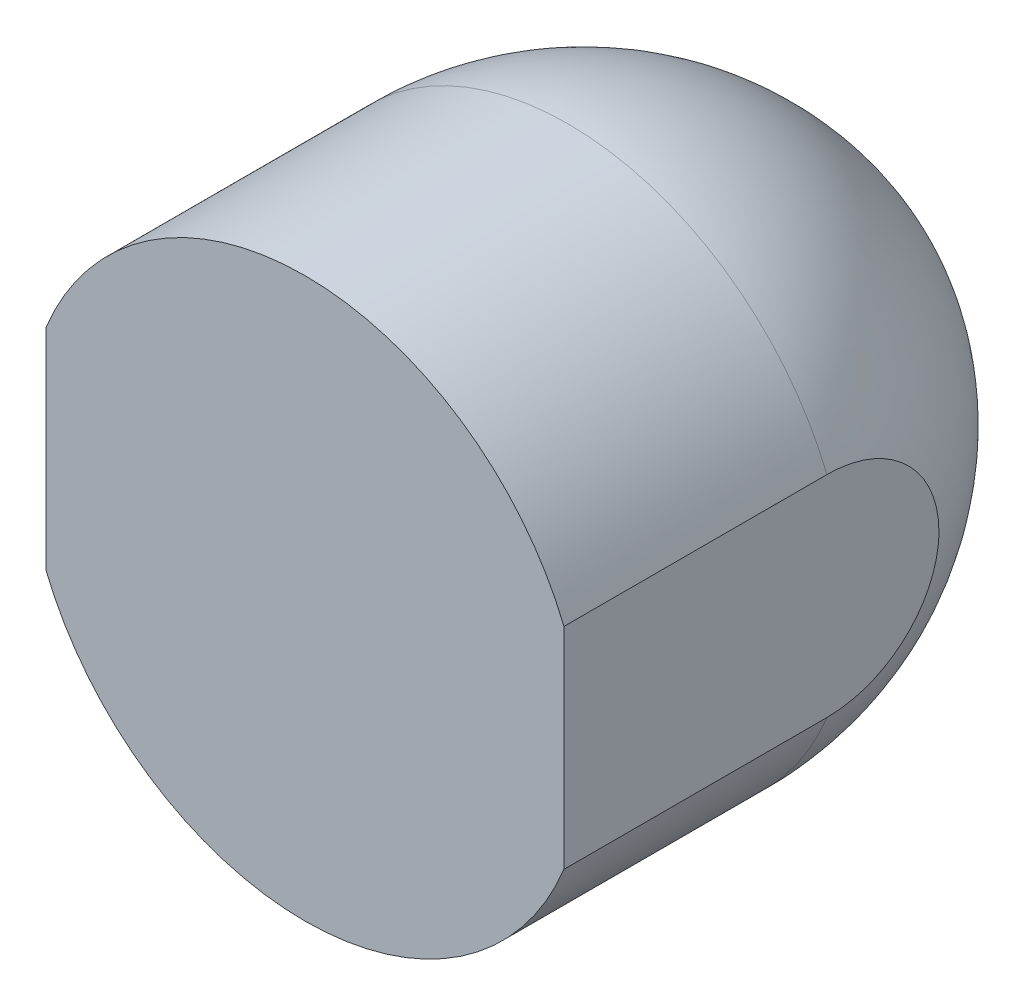
ISO-10303-21;
HEADER;
FILE_DESCRIPTION(('STEP AP214'),'2;1');
FILE_NAME('part.step','',(''),(''),'','','');
FILE_SCHEMA(('AUTOMOTIVE_DESIGN { 1 0 10303 214 1 1 1 1 }'));
ENDSEC;
DATA;
#1=APPLICATION_CONTEXT('core data for automotive mechanical design processes');
#2=APPLICATION_PROTOCOL_DEFINITION('international standard','automotive_design',2000,#1);
#3=PRODUCT_CONTEXT('',#1,'mechanical');
#4=PRODUCT('Part','Part','',(#3));
#5=PRODUCT_RELATED_PRODUCT_CATEGORY('part','',(#4));
#6=PRODUCT_DEFINITION_FORMATION('','',#4);
#7=PRODUCT_DEFINITION_CONTEXT('part definition',#1,'design');
#8=PRODUCT_DEFINITION('design','',#6,#7);
#9=PRODUCT_DEFINITION_SHAPE('','',#8);
#10=(LENGTH_UNIT() NAMED_UNIT(*) SI_UNIT(.MILLI.,.METRE.));
#11=(NAMED_UNIT(*) PLANE_ANGLE_UNIT() SI_UNIT($,.RADIAN.));
#12=(NAMED_UNIT(*) SI_UNIT($,.STERADIAN.) SOLID_ANGLE_UNIT());
#13=UNCERTAINTY_MEASURE_WITH_UNIT(LENGTH_MEASURE(1.E-05),#10,'distance_accuracy_value','');
#14=(GEOMETRIC_REPRESENTATION_CONTEXT(3) GLOBAL_UNCERTAINTY_ASSIGNED_CONTEXT((#13)) GLOBAL_UNIT_ASSIGNED_CONTEXT((#10,
#11,#12)) REPRESENTATION_CONTEXT('',''));
#15=CARTESIAN_POINT('',(0.,0.,0.));
#16=DIRECTION('',(0.,0.,1.));
#17=DIRECTION('',(1.,0.,0.));
#18=AXIS2_PLACEMENT_3D('',#15,#16,#17);
#19=CARTESIAN_POINT('',(0.,0.,0.));
#20=DIRECTION('',(0.,0.,1.));
#21=DIRECTION('',(1.,0.,0.));
#22=AXIS2_PLACEMENT_3D('',#19,#20,#21);
#23=CYLINDRICAL_SURFACE('',#22,5.315);
#24=CARTESIAN_POINT('',(0.,0.,0.));
#25=DIRECTION('',(0.,0.,1.));
#26=DIRECTION('',(1.,0.,0.));
#27=AXIS2_PLACEMENT_3D('',#24,#25,#26);
#28=CIRCLE('',#27,5.315);
#29=CARTESIAN_POINT('',(4.92435021094154,2.,0.));
#30=VERTEX_POINT('',#29);
#31=CARTESIAN_POINT('',(-4.92435021094154,2.,0.));
#32=VERTEX_POINT('',#31);
#33=EDGE_CURVE('E115',#30,#32,#28,.T.);
#34=ORIENTED_EDGE('',*,*,#33,.F.);
#35=DIRECTION('',(0.,0.,-1.));
#36=VECTOR('',#35,1.);
#37=CARTESIAN_POINT('',(4.92435021094154,2.,22.9802790586636));
#38=LINE('',#37,#36);
#39=CARTESIAN_POINT('',(4.92435021094154,2.,-5.00000000000153));
#40=VERTEX_POINT('',#39);
#41=EDGE_CURVE('E114',#30,#40,#38,.T.);
#42=ORIENTED_EDGE('',*,*,#41,.T.);
#43=CARTESIAN_POINT('',(0.,0.,-5.));
#44=DIRECTION('',(0.,0.,1.));
#45=DIRECTION('',(1.,0.,0.));
#46=AXIS2_PLACEMENT_3D('',#43,#44,#45);
#47=CIRCLE('',#46,5.315);
#48=CARTESIAN_POINT('',(-4.92435021094154,2.,-5.));
#49=VERTEX_POINT('',#48);
#50=EDGE_CURVE('E101',#40,#49,#47,.T.);
#51=ORIENTED_EDGE('',*,*,#50,.T.);
#52=DIRECTION('',(0.,0.,-1.));
#53=VECTOR('',#52,1.);
#54=CARTESIAN_POINT('',(-4.92435021094154,2.,23.2557879774949));
#55=LINE('',#54,#53);
#56=EDGE_CURVE('E126',#32,#49,#55,.T.);
#57=ORIENTED_EDGE('',*,*,#56,.F.);
#58=EDGE_LOOP('',(#34,#42,#51,#57));
#59=FACE_BOUND('',#58,.T.);
#60=ADVANCED_FACE('F50',(#59),#23,.T.);
#61=DIRECTION('',(0.,0.,-1.));
#62=VECTOR('',#61,1.);
#63=CARTESIAN_POINT('',(4.92435021094154,-2.,22.9802790586636));
#64=LINE('',#63,#62);
#65=CARTESIAN_POINT('',(4.92435021094154,-2.,0.));
#66=VERTEX_POINT('',#65);
#67=CARTESIAN_POINT('',(4.92435021094154,-2.,-5.));
#68=VERTEX_POINT('',#67);
#69=EDGE_CURVE('E79',#66,#68,#64,.T.);
#70=ORIENTED_EDGE('',*,*,#69,.F.);
#71=CARTESIAN_POINT('',(-4.92435021094154,-2.,0.));
#72=VERTEX_POINT('',#71);
#73=EDGE_CURVE('E136',#72,#66,#28,.T.);
#74=ORIENTED_EDGE('',*,*,#73,.F.);
#75=DIRECTION('',(0.,0.,-1.));
#76=VECTOR('',#75,1.);
#77=CARTESIAN_POINT('',(-4.92435021094154,-2.,23.2557879774949));
#78=LINE('',#77,#76);
#79=CARTESIAN_POINT('',(-4.92435021094154,-2.,-5.));
#80=VERTEX_POINT('',#79);
#81=EDGE_CURVE('E125',#72,#80,#78,.T.);
#82=ORIENTED_EDGE('',*,*,#81,.T.);
#83=EDGE_CURVE('E110',#80,#68,#47,.T.);
#84=ORIENTED_EDGE('',*,*,#83,.T.);
#85=EDGE_LOOP('',(#70,#74,#82,#84));
#86=FACE_BOUND('',#85,.T.);
#87=ADVANCED_FACE('F154',(#86),#23,.T.);
#88=CARTESIAN_POINT('',(0.,0.,0.));
#89=DIRECTION('',(0.,0.,1.));
#90=DIRECTION('',(1.,0.,0.));
#91=AXIS2_PLACEMENT_3D('',#88,#89,#90);
#92=PLANE('',#91);
#93=DIRECTION('',(0.,-1.,0.));
#94=VECTOR('',#93,1.);
#95=CARTESIAN_POINT('',(4.92435021094154,0.,0.));
#96=LINE('',#95,#94);
#97=EDGE_CURVE('E71',#30,#66,#96,.T.);
#98=ORIENTED_EDGE('',*,*,#97,.F.);
#99=ORIENTED_EDGE('',*,*,#33,.T.);
#100=DIRECTION('',(0.,-1.,0.));
#101=VECTOR('',#100,1.);
#102=CARTESIAN_POINT('',(-4.92435021094154,0.,0.));
#103=LINE('',#102,#101);
#104=EDGE_CURVE('E111',#32,#72,#103,.T.);
#105=ORIENTED_EDGE('',*,*,#104,.T.);
#106=ORIENTED_EDGE('',*,*,#73,.T.);
#107=EDGE_LOOP('',(#98,#99,#105,#106));
#108=FACE_BOUND('',#107,.T.);
#109=ADVANCED_FACE('F52',(#108),#92,.T.);
#110=CARTESIAN_POINT('',(-0.685,0.,-5.));
#111=DIRECTION('',(0.,-1.,0.));
#112=DIRECTION('',(1.,0.,0.));
#113=AXIS2_PLACEMENT_3D('',#110,#111,#112);
#114=CIRCLE('',#113,6.);
#115=TRIMMED_CURVE('',#114,(PARAMETER_VALUE(-1.45638018550953)),
(PARAMETER_VALUE(1.45638018550953)),.T.,.PARAMETER.);
#116=CARTESIAN_POINT('',(0.,0.,-5.));
#117=DIRECTION('',(0.,0.,1.));
#118=AXIS1_PLACEMENT('',#116,#117);
#119=SURFACE_OF_REVOLUTION('',#115,#118);
#120=CARTESIAN_POINT('',(4.92435021094154,0.,-7.12959860326074));
#121=CARTESIAN_POINT('',(4.92435021094154,0.111388284336316,-7.12959081609624));
#122=CARTESIAN_POINT('',(4.92435021094154,0.222898969085855,-7.1195907296075));
#123=CARTESIAN_POINT('',(4.92435021094154,0.442503890502322,-7.07999020523317));
#124=CARTESIAN_POINT('',(4.92435021094154,0.550591812685757,-7.05035552718025));
#125=CARTESIAN_POINT('',(4.92435021094154,0.759713787912702,-6.97283709799994));
#126=CARTESIAN_POINT('',(4.92435021094154,0.860763611001785,-6.92499580730524));
#127=CARTESIAN_POINT('',(4.92435021094154,1.05327193441051,-6.81296321223986));
#128=CARTESIAN_POINT('',(4.92435021094154,1.14473303940401,-6.74877636429666));
#129=CARTESIAN_POINT('',(4.92435021094154,1.31524803031152,-6.60684537702657));
#130=CARTESIAN_POINT('',(4.92435021094154,1.39438934353929,-6.52920589385143));
#131=CARTESIAN_POINT('',(4.92435021094154,1.53943382286217,-6.36243195499815));
#132=CARTESIAN_POINT('',(4.92435021094154,1.60533473101322,-6.27329554294703));
#133=CARTESIAN_POINT('',(4.92435021094154,1.72629570363239,-6.08017662038711));
#134=CARTESIAN_POINT('',(4.92435021094154,1.78043487487432,-5.97561720823739));
#135=CARTESIAN_POINT('',(4.92435021094154,1.87138355777602,-5.75921323726417));
#136=CARTESIAN_POINT('',(4.92435021094154,1.90818794785606,-5.64736653650003));
#137=CARTESIAN_POINT('',(4.92435021094154,1.96525435663889,-5.41338220755745));
#138=CARTESIAN_POINT('',(4.92435021094154,1.98456320614537,-5.29101146451928));
#139=CARTESIAN_POINT('',(4.92435021094154,2.00293425134514,-5.04475245356639));
#140=CARTESIAN_POINT('',(4.92435021094154,2.00199288875324,-4.92086392277457));
#141=CARTESIAN_POINT('',(4.92435021094154,1.9795869452336,-4.67172181471064));
#142=CARTESIAN_POINT('',(4.92435021094154,1.95759473421084,-4.54651517980073));
#143=CARTESIAN_POINT('',(4.92435021094154,1.8927317167567,-4.30161034889791));
#144=CARTESIAN_POINT('',(4.92435021094154,1.84986008496384,-4.18191237086642));
#145=CARTESIAN_POINT('',(4.92435021094154,1.74456959511716,-3.9526705614722));
#146=CARTESIAN_POINT('',(4.92435021094154,1.68232245376208,-3.84304808186927));
#147=CARTESIAN_POINT('',(4.92435021094154,1.539537523627,-3.63641356235644));
#148=CARTESIAN_POINT('',(4.92435021094154,1.45900335277329,-3.53939903403673));
#149=CARTESIAN_POINT('',(4.92435021094154,1.2854448477074,-3.36533916118107));
#150=CARTESIAN_POINT('',(4.92435021094154,1.19309725184549,-3.28762009118814));
#151=CARTESIAN_POINT('',(4.92435021094154,0.995937265108121,-3.15002782628413));
#152=CARTESIAN_POINT('',(4.92435021094154,0.891130268037518,-3.09014694811031));
#153=CARTESIAN_POINT('',(4.92435021094154,0.679085669592945,-2.9939338079647));
#154=CARTESIAN_POINT('',(4.92435021094154,0.572409736625026,-2.95636330184055));
#155=CARTESIAN_POINT('',(4.92435021094154,0.354083959722077,-2.90078415647459));
#156=CARTESIAN_POINT('',(4.92435021094154,0.24243601589735,-2.88276810993778));
#157=CARTESIAN_POINT('',(4.92435021094154,0.0236117013853664,-2.86750558177617));
#158=CARTESIAN_POINT('',(4.92435021094154,-0.0834936272604995,-2.86922340121465));
#159=CARTESIAN_POINT('',(4.92435021094154,-0.295837664959183,-2.8908638644222));
#160=CARTESIAN_POINT('',(4.92435021094154,-0.401076568777655,-2.91078459714523));
#161=CARTESIAN_POINT('',(4.92435021094154,-0.605454049587518,-2.96767475671745));
#162=CARTESIAN_POINT('',(4.92435021094154,-0.704650674100275,-3.00443674044997));
#163=CARTESIAN_POINT('',(4.92435021094154,-0.895746881107727,-3.09357337214418));
#164=CARTESIAN_POINT('',(4.92435021094154,-0.987645587578077,-3.14594989086006));
#165=CARTESIAN_POINT('',(4.92435021094154,-1.16488089093695,-3.26651629243262));
#166=CARTESIAN_POINT('',(4.92435021094154,-1.24990053257859,-3.33517129908479));
#167=CARTESIAN_POINT('',(4.92435021094154,-1.40799726027537,-3.48506207077591));
#168=CARTESIAN_POINT('',(4.92435021094154,-1.48107142216351,-3.56630090679483));
#169=CARTESIAN_POINT('',(4.92435021094154,-1.61770910107279,-3.74406445290551));
#170=CARTESIAN_POINT('',(4.92435021094154,-1.68047418651206,-3.8412027794568));
#171=CARTESIAN_POINT('',(4.92435021094154,-1.78982363295656,-4.04419033767337));
#172=CARTESIAN_POINT('',(4.92435021094154,-1.83640363034517,-4.15004190899278));
#173=CARTESIAN_POINT('',(4.92435021094154,-1.91471374763045,-4.37386289616066));
#174=CARTESIAN_POINT('',(4.92435021094154,-1.94545438040674,-4.49217907853447));
#175=CARTESIAN_POINT('',(4.92435021094154,-1.98738289285777,-4.73223178527231));
#176=CARTESIAN_POINT('',(4.92435021094154,-1.99856649102836,-4.85396905266839));
#177=CARTESIAN_POINT('',(4.92435021094154,-2.00121999819164,-5.10191870098301));
#178=CARTESIAN_POINT('',(4.92435021094154,-1.99198935487971,-5.22813919722855));
#179=CARTESIAN_POINT('',(4.92435021094154,-1.95253267623885,-5.47727204517889));
#180=CARTESIAN_POINT('',(4.92435021094154,-1.92230476081342,-5.60018409962191));
#181=CARTESIAN_POINT('',(4.92435021094154,-1.84135037404492,-5.83938211366062));
#182=CARTESIAN_POINT('',(4.92435021094154,-1.79057979555864,-5.95565319751973));
#183=CARTESIAN_POINT('',(4.92435021094154,-1.6696022263571,-6.17762340229917));
#184=CARTESIAN_POINT('',(4.92435021094154,-1.59939843761591,-6.28332426095363));
#185=CARTESIAN_POINT('',(4.92435021094154,-1.44383265756966,-6.47722010774136));
#186=CARTESIAN_POINT('',(4.92435021094154,-1.35905010453821,-6.56587914997245));
#187=CARTESIAN_POINT('',(4.92435021094154,-1.1749496928951,-6.72664359091557));
#188=CARTESIAN_POINT('',(4.92435021094154,-1.07563239897271,-6.79874963244884));
#189=CARTESIAN_POINT('',(4.92435021094154,-0.871531280490764,-6.91971997036061));
#190=CARTESIAN_POINT('',(4.92435021094154,-0.767405304504188,-6.96969555463998));
#191=CARTESIAN_POINT('',(4.92435021094154,-0.552002021884773,-7.05011089799906));
#192=CARTESIAN_POINT('',(4.92435021094154,-0.440740309657153,-7.08059176086378));
#193=CARTESIAN_POINT('',(4.92435021094154,-0.273682997584805,-7.11028805169918));
#194=CARTESIAN_POINT('',(4.92435021094154,-0.219208822455767,-7.11751886283337));
#195=CARTESIAN_POINT('',(4.92435021094154,-0.109833033153846,-7.12717616362175));
#196=CARTESIAN_POINT('',(4.92435021094154,-0.0549314004240601,-7.12960244351965));
#197=CARTESIAN_POINT('',(4.92435021094154,0.,-7.12959860326074));
#198=B_SPLINE_CURVE_WITH_KNOTS('',3,(#120,#121,#122,#123,#124,#125,#126,#127,#128,#129,#130,
#131,#132,#133,#134,#135,#136,#137,#138,#139,#140,#141,#142,#143,#144,#145,#146,#147,#148,#149,
#150,#151,#152,#153,#154,#155,#156,#157,#158,#159,#160,#161,#162,#163,#164,#165,#166,#167,#168,
#169,#170,#171,#172,#173,#174,#175,#176,#177,#178,#179,#180,#181,#182,#183,#184,#185,#186,#187,
#188,#189,#190,#191,#192,#193,#194,#195,#196,#197),.UNSPECIFIED.,.T.,.F.,(4,2,2,2,2,2,2,2,2,2,2,
2,2,2,2,2,2,2,2,2,2,2,2,2,2,2,2,2,2,2,2,2,2,2,2,2,2,2,4),(0.,0.333937009397587,
0.668457899560962,1.00220337302114,1.33585795186669,1.66702469376118,1.99824786311907,
2.34992732384284,2.70171062356453,3.07167341776833,3.44170122086566,3.82125328935883,
4.20082036272645,4.57711493069186,4.95333511688387,5.3135573543352,5.67362421184606,
6.01117870134139,6.34860527938787,6.66840714099602,6.98817543183108,7.30410668194259,
7.62007579852887,7.94648010025844,8.27296418413466,8.61840235918174,8.96393359472374,
9.32901781542802,9.69418195182713,10.072071122983,10.4499941347111,10.8287329275084,
11.2074093533231,11.5735365674754,11.9396495609923,12.284384224535,12.6283896125196,
12.7930642629571,12.9577461026041),.UNSPECIFIED.);
#199=EDGE_CURVE('E12',#68,#40,#198,.T.);
#200=ORIENTED_EDGE('',*,*,#199,.F.);
#201=ORIENTED_EDGE('',*,*,#83,.F.);
#202=CARTESIAN_POINT('',(-4.92435021094154,0.,-7.12959860326074));
#203=CARTESIAN_POINT('',(-4.92435021094154,0.111388284336316,-7.12959081609624));
#204=CARTESIAN_POINT('',(-4.92435021094154,0.222898969085856,-7.1195907296075));
#205=CARTESIAN_POINT('',(-4.92435021094154,0.442503890502322,-7.07999020523317));
#206=CARTESIAN_POINT('',(-4.92435021094154,0.550591812685757,-7.05035552718025));
#207=CARTESIAN_POINT('',(-4.92435021094154,0.759713787912702,-6.97283709799994));
#208=CARTESIAN_POINT('',(-4.92435021094154,0.860763611001785,-6.92499580730524));
#209=CARTESIAN_POINT('',(-4.92435021094154,1.05327193441051,-6.81296321223986));
#210=CARTESIAN_POINT('',(-4.92435021094154,1.14473303940401,-6.74877636429666));
#211=CARTESIAN_POINT('',(-4.92435021094154,1.31524803031152,-6.60684537702657));
#212=CARTESIAN_POINT('',(-4.92435021094154,1.39438934353929,-6.52920589385143));
#213=CARTESIAN_POINT('',(-4.92435021094154,1.53943382286217,-6.36243195499815));
#214=CARTESIAN_POINT('',(-4.92435021094154,1.60533473101322,-6.27329554294703));
#215=CARTESIAN_POINT('',(-4.92435021094154,1.72629570363239,-6.08017662038711));
#216=CARTESIAN_POINT('',(-4.92435021094154,1.78043487487432,-5.97561720823739));
#217=CARTESIAN_POINT('',(-4.92435021094154,1.87138355777602,-5.75921323726417));
#218=CARTESIAN_POINT('',(-4.92435021094154,1.90818794785606,-5.64736653650003));
#219=CARTESIAN_POINT('',(-4.92435021094154,1.96525435663889,-5.41338220755745));
#220=CARTESIAN_POINT('',(-4.92435021094154,1.98456320614537,-5.29101146451928));
#221=CARTESIAN_POINT('',(-4.92435021094154,2.00293425134514,-5.04475245356639));
#222=CARTESIAN_POINT('',(-4.92435021094154,2.00199288875324,-4.92086392277457));
#223=CARTESIAN_POINT('',(-4.92435021094154,1.9795869452336,-4.67172181471064));
#224=CARTESIAN_POINT('',(-4.92435021094154,1.95759473421084,-4.54651517980073));
#225=CARTESIAN_POINT('',(-4.92435021094154,1.8927317167567,-4.30161034889791));
#226=CARTESIAN_POINT('',(-4.92435021094154,1.84986008496384,-4.18191237086642));
#227=CARTESIAN_POINT('',(-4.92435021094154,1.74456959511716,-3.9526705614722));
#228=CARTESIAN_POINT('',(-4.92435021094154,1.68232245376208,-3.84304808186927));
#229=CARTESIAN_POINT('',(-4.92435021094154,1.539537523627,-3.63641356235644));
#230=CARTESIAN_POINT('',(-4.92435021094154,1.45900335277329,-3.53939903403673));
#231=CARTESIAN_POINT('',(-4.92435021094154,1.2854448477074,-3.36533916118107));
#232=CARTESIAN_POINT('',(-4.92435021094154,1.19309725184549,-3.28762009118814));
#233=CARTESIAN_POINT('',(-4.92435021094154,0.995937265108121,-3.15002782628414));
#234=CARTESIAN_POINT('',(-4.92435021094154,0.891130268037518,-3.09014694811031));
#235=CARTESIAN_POINT('',(-4.92435021094154,0.679085669592946,-2.9939338079647));
#236=CARTESIAN_POINT('',(-4.92435021094154,0.572409736625027,-2.95636330184055));
#237=CARTESIAN_POINT('',(-4.92435021094154,0.354083959722078,-2.90078415647459));
#238=CARTESIAN_POINT('',(-4.92435021094154,0.242436015897351,-2.88276810993778));
#239=CARTESIAN_POINT('',(-4.92435021094154,0.0236117013853675,-2.86750558177617));
#240=CARTESIAN_POINT('',(-4.92435021094154,-0.0834936272604984,-2.86922340121465));
#241=CARTESIAN_POINT('',(-4.92435021094154,-0.295837664959183,-2.8908638644222));
#242=CARTESIAN_POINT('',(-4.92435021094154,-0.401076568777654,-2.91078459714523));
#243=CARTESIAN_POINT('',(-4.92435021094154,-0.605454049587517,-2.96767475671745));
#244=CARTESIAN_POINT('',(-4.92435021094154,-0.704650674100274,-3.00443674044997));
#245=CARTESIAN_POINT('',(-4.92435021094154,-0.895746881107726,-3.09357337214418));
#246=CARTESIAN_POINT('',(-4.92435021094154,-0.987645587578077,-3.14594989086007));
#247=CARTESIAN_POINT('',(-4.92435021094154,-1.16488089093695,-3.26651629243262));
#248=CARTESIAN_POINT('',(-4.92435021094154,-1.24990053257859,-3.33517129908479));
#249=CARTESIAN_POINT('',(-4.92435021094154,-1.40799726027537,-3.48506207077591));
#250=CARTESIAN_POINT('',(-4.92435021094154,-1.48107142216351,-3.56630090679483));
#251=CARTESIAN_POINT('',(-4.92435021094154,-1.61770910107279,-3.74406445290551));
#252=CARTESIAN_POINT('',(-4.92435021094154,-1.68047418651206,-3.8412027794568));
#253=CARTESIAN_POINT('',(-4.92435021094154,-1.78982363295657,-4.04419033767337));
#254=CARTESIAN_POINT('',(-4.92435021094154,-1.83640363034517,-4.15004190899278));
#255=CARTESIAN_POINT('',(-4.92435021094154,-1.91471374763045,-4.37386289616066));
#256=CARTESIAN_POINT('',(-4.92435021094154,-1.94545438040674,-4.49217907853447));
#257=CARTESIAN_POINT('',(-4.92435021094154,-1.98738289285777,-4.73223178527231));
#258=CARTESIAN_POINT('',(-4.92435021094154,-1.99856649102836,-4.85396905266839));
#259=CARTESIAN_POINT('',(-4.92435021094154,-2.00121999819164,-5.10191870098301));
#260=CARTESIAN_POINT('',(-4.92435021094154,-1.99198935487971,-5.22813919722855));
#261=CARTESIAN_POINT('',(-4.92435021094154,-1.95253267623885,-5.47727204517889));
#262=CARTESIAN_POINT('',(-4.92435021094154,-1.92230476081342,-5.60018409962191));
#263=CARTESIAN_POINT('',(-4.92435021094154,-1.84135037404492,-5.83938211366062));
#264=CARTESIAN_POINT('',(-4.92435021094154,-1.79057979555864,-5.95565319751973));
#265=CARTESIAN_POINT('',(-4.92435021094154,-1.6696022263571,-6.17762340229917));
#266=CARTESIAN_POINT('',(-4.92435021094154,-1.59939843761591,-6.28332426095363));
#267=CARTESIAN_POINT('',(-4.92435021094154,-1.44383265756966,-6.47722010774136));
#268=CARTESIAN_POINT('',(-4.92435021094154,-1.35905010453821,-6.56587914997245));
#269=CARTESIAN_POINT('',(-4.92435021094154,-1.1749496928951,-6.72664359091556));
#270=CARTESIAN_POINT('',(-4.92435021094154,-1.07563239897271,-6.79874963244884));
#271=CARTESIAN_POINT('',(-4.92435021094154,-0.871531280490767,-6.91971997036061));
#272=CARTESIAN_POINT('',(-4.92435021094154,-0.767405304504192,-6.96969555463998));
#273=CARTESIAN_POINT('',(-4.92435021094154,-0.552002021884776,-7.05011089799906));
#274=CARTESIAN_POINT('',(-4.92435021094154,-0.440740309657155,-7.08059176086378));
#275=CARTESIAN_POINT('',(-4.92435021094154,-0.273682997584806,-7.11028805169918));
#276=CARTESIAN_POINT('',(-4.92435021094154,-0.219208822455767,-7.11751886283337));
#277=CARTESIAN_POINT('',(-4.92435021094154,-0.109833033153846,-7.12717616362175));
#278=CARTESIAN_POINT('',(-4.92435021094154,-0.0549314004240598,-7.12960244351965));
#279=CARTESIAN_POINT('',(-4.92435021094154,0.,-7.12959860326074));
#280=B_SPLINE_CURVE_WITH_KNOTS('',3,(#202,#203,#204,#205,#206,#207,#208,#209,#210,#211,#212,
#213,#214,#215,#216,#217,#218,#219,#220,#221,#222,#223,#224,#225,#226,#227,#228,#229,#230,#231,
#232,#233,#234,#235,#236,#237,#238,#239,#240,#241,#242,#243,#244,#245,#246,#247,#248,#249,#250,
#251,#252,#253,#254,#255,#256,#257,#258,#259,#260,#261,#262,#263,#264,#265,#266,#267,#268,#269,
#270,#271,#272,#273,#274,#275,#276,#277,#278,#279),.UNSPECIFIED.,.T.,.F.,(4,2,2,2,2,2,2,2,2,2,2,
2,2,2,2,2,2,2,2,2,2,2,2,2,2,2,2,2,2,2,2,2,2,2,2,2,2,2,4),(0.,0.333937009397587,
0.668457899560963,1.00220337302114,1.33585795186669,1.66702469376118,1.99824786311907,
2.34992732384284,2.70171062356453,3.07167341776833,3.44170122086566,3.82125328935883,
4.20082036272645,4.57711493069186,4.95333511688387,5.3135573543352,5.67362421184606,
6.01117870134138,6.34860527938787,6.66840714099602,6.98817543183107,7.30410668194259,
7.62007579852887,7.94648010025844,8.27296418413466,8.61840235918174,8.96393359472374,
9.32901781542802,9.69418195182713,10.072071122983,10.4499941347111,10.8287329275084,
11.2074093533231,11.5735365674754,11.9396495609923,12.284384224535,12.6283896125196,
12.7930642629571,12.9577461026041),.UNSPECIFIED.);
#281=EDGE_CURVE('E64',#80,#49,#280,.T.);
#282=ORIENTED_EDGE('',*,*,#281,.T.);
#283=ORIENTED_EDGE('',*,*,#50,.F.);
#284=EDGE_LOOP('',(#200,#201,#282,#283));
#285=FACE_BOUND('',#284,.T.);
#286=CARTESIAN_POINT('',(0.,0.,-10.9607696650684));
#287=VERTEX_POINT('',#286);
#288=VERTEX_LOOP('',#287);
#289=FACE_BOUND('',#288,.T.);
#290=ADVANCED_FACE('F103',(#285,#289),#119,.T.);
#291=CARTESIAN_POINT('',(-4.92435021094154,-2.,23.2557879774949));
#292=DIRECTION('',(-1.,0.,0.));
#293=DIRECTION('',(0.,0.,1.));
#294=AXIS2_PLACEMENT_3D('',#291,#292,#293);
#295=PLANE('',#294);
#296=ORIENTED_EDGE('',*,*,#104,.F.);
#297=ORIENTED_EDGE('',*,*,#56,.T.);
#298=ORIENTED_EDGE('',*,*,#281,.F.);
#299=ORIENTED_EDGE('',*,*,#81,.F.);
#300=EDGE_LOOP('',(#296,#297,#298,#299));
#301=FACE_BOUND('',#300,.T.);
#302=ADVANCED_FACE('F144',(#301),#295,.T.);
#303=CARTESIAN_POINT('',(4.92435021094154,-2.,22.9802790586636));
#304=DIRECTION('',(-1.,0.,0.));
#305=DIRECTION('',(0.,0.,1.));
#306=AXIS2_PLACEMENT_3D('',#303,#304,#305);
#307=PLANE('',#306);
#308=ORIENTED_EDGE('',*,*,#41,.F.);
#309=ORIENTED_EDGE('',*,*,#97,.T.);
#310=ORIENTED_EDGE('',*,*,#69,.T.);
#311=ORIENTED_EDGE('',*,*,#199,.T.);
#312=EDGE_LOOP('',(#308,#309,#310,#311));
#313=FACE_BOUND('',#312,.T.);
#314=ADVANCED_FACE('F119',(#313),#307,.F.);
#315=CLOSED_SHELL('',(#60,#87,#109,#290,#302,#314));
#316=MANIFOLD_SOLID_BREP('B2',#315);
#317=ADVANCED_BREP_SHAPE_REPRESENTATION('',(#18,#316),#14);
#318=SHAPE_DEFINITION_REPRESENTATION(#9,#317);
ENDSEC;
END-ISO-10303-21;
